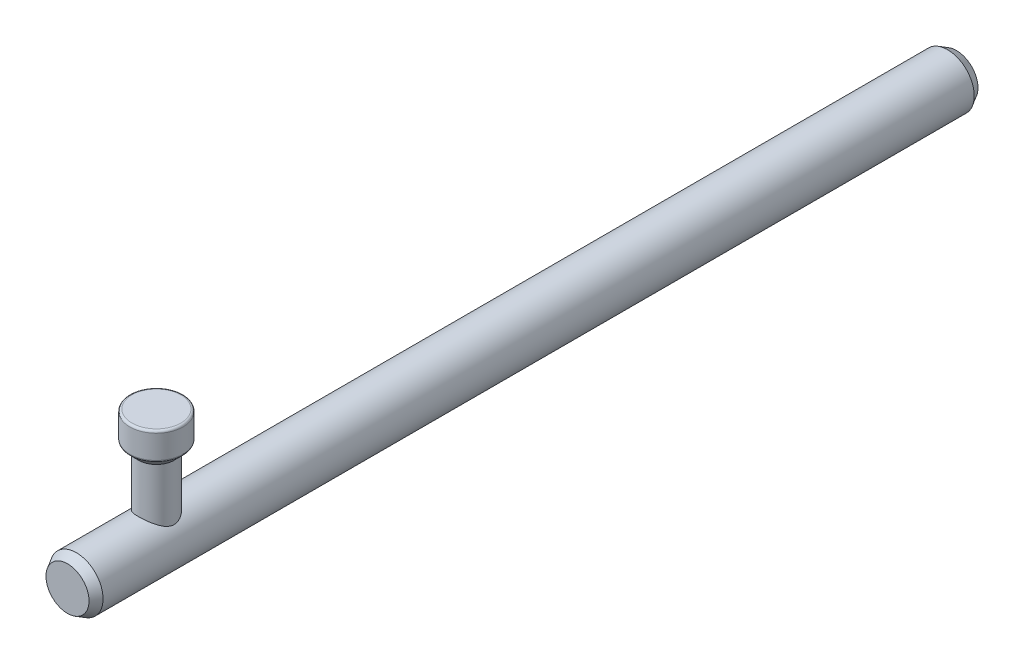
ISO-10303-21;
HEADER;
FILE_DESCRIPTION(('STEP AP214'),'2;1');
FILE_NAME('part.step','',(''),(''),'','','');
FILE_SCHEMA(('AUTOMOTIVE_DESIGN { 1 0 10303 214 1 1 1 1 }'));
ENDSEC;
DATA;
#1=APPLICATION_CONTEXT('core data for automotive mechanical design processes');
#2=APPLICATION_PROTOCOL_DEFINITION('international standard','automotive_design',2000,#1);
#3=PRODUCT_CONTEXT('',#1,'mechanical');
#4=PRODUCT('Part','Part','',(#3));
#5=PRODUCT_RELATED_PRODUCT_CATEGORY('part','',(#4));
#6=PRODUCT_DEFINITION_FORMATION('','',#4);
#7=PRODUCT_DEFINITION_CONTEXT('part definition',#1,'design');
#8=PRODUCT_DEFINITION('design','',#6,#7);
#9=PRODUCT_DEFINITION_SHAPE('','',#8);
#10=(LENGTH_UNIT() NAMED_UNIT(*) SI_UNIT(.MILLI.,.METRE.));
#11=(NAMED_UNIT(*) PLANE_ANGLE_UNIT() SI_UNIT($,.RADIAN.));
#12=(NAMED_UNIT(*) SI_UNIT($,.STERADIAN.) SOLID_ANGLE_UNIT());
#13=UNCERTAINTY_MEASURE_WITH_UNIT(LENGTH_MEASURE(1.E-05),#10,'distance_accuracy_value','');
#14=(GEOMETRIC_REPRESENTATION_CONTEXT(3) GLOBAL_UNCERTAINTY_ASSIGNED_CONTEXT((#13)) GLOBAL_UNIT_ASSIGNED_CONTEXT((#10,
#11,#12)) REPRESENTATION_CONTEXT('',''));
#15=CARTESIAN_POINT('',(0.,0.,0.));
#16=DIRECTION('',(0.,0.,1.));
#17=DIRECTION('',(1.,0.,0.));
#18=AXIS2_PLACEMENT_3D('',#15,#16,#17);
#19=CARTESIAN_POINT('',(0.,25.,30.));
#20=DIRECTION('',(0.,-1.,0.));
#21=DIRECTION('',(0.,0.,-1.));
#22=AXIS2_PLACEMENT_3D('',#19,#20,#21);
#23=CYLINDRICAL_SURFACE('',#22,4.);
#24=CARTESIAN_POINT('',(0.,6.,26.));
#25=CARTESIAN_POINT('',(0.200961877757264,5.9999978679194,26.000002684907));
#26=CARTESIAN_POINT('',(0.401936080773152,5.9898153135426,26.0152288882032));
#27=CARTESIAN_POINT('',(0.79746821055015,5.95009379035347,26.0751927794688));
#28=CARTESIAN_POINT('',(0.992023045089949,5.92054563204444,26.1199444781421));
#29=CARTESIAN_POINT('',(1.36842380232543,5.84500964767637,26.2362154427165));
#30=CARTESIAN_POINT('',(1.55032457441004,5.79909884319835,26.3076093722615));
#31=CARTESIAN_POINT('',(1.89883175306967,5.69452202411023,26.4741276344292));
#32=CARTESIAN_POINT('',(2.06543593424075,5.63585415772491,26.569255412479));
#33=CARTESIAN_POINT('',(2.3945652020353,5.50454977078536,26.7893099259876));
#34=CARTESIAN_POINT('',(2.55554447844211,5.43115036221203,26.9160803248433));
#35=CARTESIAN_POINT('',(2.85547224517315,5.27963383311262,27.1914755162046));
#36=CARTESIAN_POINT('',(2.994388569064,5.20151004959,27.3401316196154));
#37=CARTESIAN_POINT('',(3.19492879965059,5.07935723703535,27.5903838554454));
#38=CARTESIAN_POINT('',(3.26448421361659,5.03481061406829,27.6854700193812));
#39=CARTESIAN_POINT('',(3.39528506509656,4.94754748204559,27.8819829514974));
#40=CARTESIAN_POINT('',(3.45652861568795,4.90483139004999,27.9834111518107));
#41=CARTESIAN_POINT('',(3.62693348295433,4.78172496846676,28.2965761834164));
#42=CARTESIAN_POINT('',(3.72317686184202,4.70611539319262,28.5176988553784));
#43=CARTESIAN_POINT('',(3.85349251209103,4.59951859417335,28.9134467329049));
#44=CARTESIAN_POINT('',(3.89749210756546,4.56195075343585,29.08306337131));
#45=CARTESIAN_POINT('',(3.96300919832951,4.5051611944835,29.4294825551035));
#46=CARTESIAN_POINT('',(3.98456544550022,4.48590785845124,29.6062721648702));
#47=CARTESIAN_POINT('',(4.0038281338153,4.46873162662322,29.962951297351));
#48=CARTESIAN_POINT('',(4.00143708609998,4.47089592105774,30.1428505125676));
#49=CARTESIAN_POINT('',(3.97275139872465,4.49639563989106,30.4992694809422));
#50=CARTESIAN_POINT('',(3.94643650788514,4.51974900048769,30.6757862416243));
#51=CARTESIAN_POINT('',(3.8732999414292,4.58254368658664,31.0129342195374));
#52=CARTESIAN_POINT('',(3.82743424461755,4.62122975554716,31.1739227038778));
#53=CARTESIAN_POINT('',(3.7174023558469,4.71019246530652,31.4860473508856));
#54=CARTESIAN_POINT('',(3.65323014197261,4.76047291902481,31.6371802514341));
#55=CARTESIAN_POINT('',(3.49347638019647,4.87928392523269,31.9580508015759));
#56=CARTESIAN_POINT('',(3.39416104750469,4.94944635418484,32.1253198038974));
#57=CARTESIAN_POINT('',(3.17337920726675,5.09383075529723,32.4427667876367));
#58=CARTESIAN_POINT('',(3.05188537955521,5.16805765436997,32.5929233146677));
#59=CARTESIAN_POINT('',(2.75962330697744,5.33086687505155,32.9050850922479));
#60=CARTESIAN_POINT('',(2.58387876581438,5.41909489435193,33.0626680976423));
#61=CARTESIAN_POINT('',(2.20401599801903,5.58436201336345,33.3463929888004));
#62=CARTESIAN_POINT('',(1.99992459865342,5.6614115529751,33.4725642907514));
#63=CARTESIAN_POINT('',(1.60971565422037,5.78290808179582,33.6669554372993));
#64=CARTESIAN_POINT('',(1.42791528675113,5.83078522330773,33.7416867266922));
#65=CARTESIAN_POINT('',(1.05207208786365,5.91015438061304,33.8642098512364));
#66=CARTESIAN_POINT('',(0.858039758001339,5.9416602425517,33.9120244542606));
#67=CARTESIAN_POINT('',(0.461970906346524,5.98551764313533,33.9783223304799));
#68=CARTESIAN_POINT('',(0.259903623868821,5.99778644922351,33.9966789218776));
#69=CARTESIAN_POINT('',(-0.144883038779208,6.00166229930316,34.0024941771234));
#70=CARTESIAN_POINT('',(-0.347602372373328,5.99327078771277,33.9899550009772));
#71=CARTESIAN_POINT('',(-0.732911434408415,5.95799178848538,33.9367518888764));
#72=CARTESIAN_POINT('',(-0.915914889358571,5.93244492780442,33.8981254044898));
#73=CARTESIAN_POINT('',(-1.27223278485463,5.86636898569683,33.7968086279741));
#74=CARTESIAN_POINT('',(-1.44554567514149,5.82583751494007,33.734114498143));
#75=CARTESIAN_POINT('',(-1.78932950093283,5.72992705058283,33.5826954059108));
#76=CARTESIAN_POINT('',(-1.95899236926607,5.6737974027145,33.4926236918387));
#77=CARTESIAN_POINT('',(-2.28136604791135,5.55203711223142,33.291133420105));
#78=CARTESIAN_POINT('',(-2.43406629638971,5.48640060808333,33.1797016789266));
#79=CARTESIAN_POINT('',(-2.7437089096605,5.33909093306338,32.9187842636954));
#80=CARTESIAN_POINT('',(-2.89750375144749,5.25652313598236,32.7660674798918));
#81=CARTESIAN_POINT('',(-3.17867936133274,5.09142346174011,32.4377771400438));
#82=CARTESIAN_POINT('',(-3.30604187293363,5.00889164843552,32.2621879216275));
#83=CARTESIAN_POINT('',(-3.52249553117939,4.85879357933962,31.9057151746079));
#84=CARTESIAN_POINT('',(-3.61391272319835,4.79055194025588,31.7265359335926));
#85=CARTESIAN_POINT('',(-3.76992427411385,4.66877948558076,31.3522546945967));
#86=CARTESIAN_POINT('',(-3.83456691107298,4.61522225155449,31.157182121472));
#87=CARTESIAN_POINT('',(-3.9247168714152,4.53866416286692,30.7908710271828));
#88=CARTESIAN_POINT('',(-3.95517195853461,4.51189995773817,30.6216563856293));
#89=CARTESIAN_POINT('',(-3.99398411126519,4.477589331452,30.2788534319877));
#90=CARTESIAN_POINT('',(-4.00236517901677,4.47002203690265,30.1052700778009));
#91=CARTESIAN_POINT('',(-3.99647846633069,4.47528401304741,29.7587139064845));
#92=CARTESIAN_POINT('',(-3.98219727499794,4.48812536101584,29.5857415116217));
#93=CARTESIAN_POINT('',(-3.93193984471959,4.53220908525283,29.2453128684672));
#94=CARTESIAN_POINT('',(-3.89593466197412,4.56347600940483,29.0778642942634));
#95=CARTESIAN_POINT('',(-3.7918611850225,4.65053670224448,28.7085779792256));
#96=CARTESIAN_POINT('',(-3.71780572154622,4.71064593401662,28.5094660511132));
#97=CARTESIAN_POINT('',(-3.54168854300469,4.8444439609485,28.1290248521502));
#98=CARTESIAN_POINT('',(-3.43958750756441,4.91815177355726,27.9477210367039));
#99=CARTESIAN_POINT('',(-3.20797320614046,5.07234090111959,27.6014418943788));
#100=CARTESIAN_POINT('',(-3.07799480000577,5.15292108876611,27.4368238567084));
#101=CARTESIAN_POINT('',(-2.79340674971918,5.3125766931074,27.1293336893786));
#102=CARTESIAN_POINT('',(-2.63878955904371,5.39165164043383,26.9864682485441));
#103=CARTESIAN_POINT('',(-2.37780795718262,5.50971336238147,26.7812049322995));
#104=CARTESIAN_POINT('',(-2.27907205499528,5.55138661480074,26.7105163844043));
#105=CARTESIAN_POINT('',(-2.07453205585637,5.63101613508227,26.5778421431842));
#106=CARTESIAN_POINT('',(-1.96873124035977,5.66897410866294,26.5158524504125));
#107=CARTESIAN_POINT('',(-1.75068617470796,5.74005451433883,26.4013561420063));
#108=CARTESIAN_POINT('',(-1.63844803554364,5.77318143009499,26.3488407225116));
#109=CARTESIAN_POINT('',(-1.40828926088828,5.83360071790147,26.254038767796));
#110=CARTESIAN_POINT('',(-1.2903706384399,5.86089513849429,26.2117486404655));
#111=CARTESIAN_POINT('',(-0.982973724349344,5.92199193347713,26.1177431172572));
#112=CARTESIAN_POINT('',(-0.790052409981754,5.95101863539404,26.0737919233841));
#113=CARTESIAN_POINT('',(-0.398088285460987,5.99001656656924,26.0149299438736));
#114=CARTESIAN_POINT('',(-0.199050188671042,6.00000211179877,25.9999973406337));
#115=CARTESIAN_POINT('',(0.,6.,26.));
#116=B_SPLINE_CURVE_WITH_KNOTS('',3,(#24,#25,#26,#27,#28,#29,#30,#31,#32,#33,#34,#35,#36,#37,
#38,#39,#40,#41,#42,#43,#44,#45,#46,#47,#48,#49,#50,#51,#52,#53,#54,#55,#56,#57,#58,#59,#60,#61,
#62,#63,#64,#65,#66,#67,#68,#69,#70,#71,#72,#73,#74,#75,#76,#77,#78,#79,#80,#81,#82,#83,#84,#85,
#86,#87,#88,#89,#90,#91,#92,#93,#94,#95,#96,#97,#98,#99,#100,#101,#102,#103,#104,#105,#106,#107,
#108,#109,#110,#111,#112,#113,#114,#115),.UNSPECIFIED.,.T.,.F.,(4,2,2,2,2,2,2,2,2,2,2,2,2,2,2,2,
2,2,2,2,2,2,2,2,2,2,2,2,2,2,2,2,2,2,2,2,2,2,2,2,2,2,2,2,2,4),(0.,0.602106453010799,
1.20449882869738,1.80409230638046,2.40377287734773,3.05434058001113,3.70584823208637,
4.08328599770793,4.46080930477325,5.21378174776238,5.74934951237418,6.28399099576978,
6.82080987356117,7.35808358412064,7.87165288288699,8.38539131508568,9.00362713220158,
9.62262971458524,10.3750547289191,11.1267724450113,11.7311573929193,12.3350303418404,
12.9414933048691,13.5479138696524,14.1117373348335,14.6756507417495,15.2737225755744,
15.8721647378882,16.5652391618099,17.2587907024993,17.8936743450736,18.5274081717986,
19.0471565993068,19.5663396456459,20.085830044675,20.6060141160321,21.264807813068,
21.9245299065432,22.5962605430738,23.2681973183871,23.6528866112052,24.0373984529808,
24.4215511301868,24.8055686591805,25.4023963552989,25.9987751531553),.UNSPECIFIED.);
#117=CARTESIAN_POINT('',(0.,6.,26.));
#118=VERTEX_POINT('',#117);
#119=EDGE_CURVE('E74',#118,#118,#116,.T.);
#120=ORIENTED_EDGE('',*,*,#119,.F.);
#121=EDGE_LOOP('',(#120));
#122=FACE_BOUND('',#121,.T.);
#123=CARTESIAN_POINT('',(0.,17.,30.));
#124=DIRECTION('',(0.,1.,0.));
#125=DIRECTION('',(0.,0.,1.));
#126=AXIS2_PLACEMENT_3D('',#123,#124,#125);
#127=CIRCLE('',#126,4.);
#128=CARTESIAN_POINT('',(0.,17.,34.));
#129=VERTEX_POINT('',#128);
#130=EDGE_CURVE('E71',#129,#129,#127,.T.);
#131=ORIENTED_EDGE('',*,*,#130,.F.);
#132=EDGE_LOOP('',(#131));
#133=FACE_BOUND('',#132,.T.);
#134=ADVANCED_FACE('F39',(#122,#133),#23,.T.);
#135=CARTESIAN_POINT('',(0.,0.,-150.));
#136=DIRECTION('',(0.,0.,1.));
#137=DIRECTION('',(1.,0.,0.));
#138=AXIS2_PLACEMENT_3D('',#135,#136,#137);
#139=CYLINDRICAL_SURFACE('',#138,6.);
#140=CARTESIAN_POINT('',(0.,0.,-148.));
#141=DIRECTION('',(0.,0.,1.));
#142=DIRECTION('',(1.,0.,0.));
#143=AXIS2_PLACEMENT_3D('',#140,#141,#142);
#144=CIRCLE('',#143,6.);
#145=CARTESIAN_POINT('',(6.,0.,-148.));
#146=VERTEX_POINT('',#145);
#147=EDGE_CURVE('E65',#146,#146,#144,.T.);
#148=ORIENTED_EDGE('',*,*,#147,.T.);
#149=EDGE_LOOP('',(#148));
#150=FACE_BOUND('',#149,.T.);
#151=CARTESIAN_POINT('',(0.,0.,48.));
#152=DIRECTION('',(0.,0.,1.));
#153=DIRECTION('',(1.,0.,0.));
#154=AXIS2_PLACEMENT_3D('',#151,#152,#153);
#155=CIRCLE('',#154,6.);
#156=CARTESIAN_POINT('',(6.,0.,48.));
#157=VERTEX_POINT('',#156);
#158=EDGE_CURVE('E68',#157,#157,#155,.F.);
#159=ORIENTED_EDGE('',*,*,#158,.T.);
#160=EDGE_LOOP('',(#159));
#161=FACE_BOUND('',#160,.T.);
#162=ORIENTED_EDGE('',*,*,#119,.T.);
#163=EDGE_LOOP('',(#162));
#164=FACE_BOUND('',#163,.T.);
#165=ADVANCED_FACE('F81',(#150,#161,#164),#139,.T.);
#166=CARTESIAN_POINT('',(0.,0.,-150.));
#167=DIRECTION('',(0.,0.,1.));
#168=DIRECTION('',(1.,0.,0.));
#169=AXIS2_PLACEMENT_3D('',#166,#167,#168);
#170=PLANE('',#169);
#171=CARTESIAN_POINT('',(0.,0.,-150.));
#172=DIRECTION('',(0.,0.,1.));
#173=DIRECTION('',(1.,0.,0.));
#174=AXIS2_PLACEMENT_3D('',#171,#172,#173);
#175=CIRCLE('',#174,4.84529946162073);
#176=CARTESIAN_POINT('',(4.84529946162073,0.,-150.));
#177=VERTEX_POINT('',#176);
#178=EDGE_CURVE('E62',#177,#177,#175,.F.);
#179=ORIENTED_EDGE('',*,*,#178,.T.);
#180=EDGE_LOOP('',(#179));
#181=FACE_BOUND('',#180,.T.);
#182=ADVANCED_FACE('F95',(#181),#170,.F.);
#183=CARTESIAN_POINT('',(0.,0.,50.));
#184=DIRECTION('',(0.,0.,1.));
#185=DIRECTION('',(1.,0.,0.));
#186=AXIS2_PLACEMENT_3D('',#183,#184,#185);
#187=PLANE('',#186);
#188=CARTESIAN_POINT('',(0.,0.,50.));
#189=DIRECTION('',(0.,0.,1.));
#190=DIRECTION('',(1.,0.,0.));
#191=AXIS2_PLACEMENT_3D('',#188,#189,#190);
#192=CIRCLE('',#191,4.84529946162073);
#193=CARTESIAN_POINT('',(4.84529946162073,0.,50.));
#194=VERTEX_POINT('',#193);
#195=EDGE_CURVE('E59',#194,#194,#192,.T.);
#196=ORIENTED_EDGE('',*,*,#195,.T.);
#197=EDGE_LOOP('',(#196));
#198=FACE_BOUND('',#197,.T.);
#199=ADVANCED_FACE('F92',(#198),#187,.T.);
#200=CARTESIAN_POINT('',(0.,17.,30.));
#201=DIRECTION('',(0.,1.,0.));
#202=DIRECTION('',(0.,0.,1.));
#203=AXIS2_PLACEMENT_3D('',#200,#201,#202);
#204=CYLINDRICAL_SURFACE('',#203,6.);
#205=CARTESIAN_POINT('',(0.,19.2071067811865,30.));
#206=DIRECTION('',(0.,-1.,0.));
#207=DIRECTION('',(0.,0.,-1.));
#208=AXIS2_PLACEMENT_3D('',#205,#206,#207);
#209=CIRCLE('',#208,6.);
#210=CARTESIAN_POINT('',(0.,19.2071067811865,24.));
#211=VERTEX_POINT('',#210);
#212=EDGE_CURVE('E50',#211,#211,#209,.F.);
#213=ORIENTED_EDGE('',*,*,#212,.T.);
#214=EDGE_LOOP('',(#213));
#215=FACE_BOUND('',#214,.T.);
#216=CARTESIAN_POINT('',(0.,24.5,30.));
#217=DIRECTION('',(0.,1.,0.));
#218=DIRECTION('',(0.,0.,1.));
#219=AXIS2_PLACEMENT_3D('',#216,#217,#218);
#220=CIRCLE('',#219,6.);
#221=CARTESIAN_POINT('',(0.,24.5,36.));
#222=VERTEX_POINT('',#221);
#223=EDGE_CURVE('E54',#222,#222,#220,.F.);
#224=ORIENTED_EDGE('',*,*,#223,.T.);
#225=EDGE_LOOP('',(#224));
#226=FACE_BOUND('',#225,.T.);
#227=ADVANCED_FACE('F94',(#215,#226),#204,.T.);
#228=CARTESIAN_POINT('',(0.,25.,30.));
#229=DIRECTION('',(0.,1.,0.));
#230=DIRECTION('',(0.,0.,1.));
#231=AXIS2_PLACEMENT_3D('',#228,#229,#230);
#232=PLANE('',#231);
#233=CARTESIAN_POINT('',(0.,25.,30.));
#234=DIRECTION('',(0.,1.,0.));
#235=DIRECTION('',(0.,0.,1.));
#236=AXIS2_PLACEMENT_3D('',#233,#234,#235);
#237=CIRCLE('',#236,5.5);
#238=CARTESIAN_POINT('',(0.,25.,35.5));
#239=VERTEX_POINT('',#238);
#240=EDGE_CURVE('E10',#239,#239,#237,.T.);
#241=ORIENTED_EDGE('',*,*,#240,.T.);
#242=EDGE_LOOP('',(#241));
#243=FACE_BOUND('',#242,.T.);
#244=ADVANCED_FACE('F90',(#243),#232,.T.);
#245=CARTESIAN_POINT('',(0.,0.,-148.));
#246=DIRECTION('',(0.,0.,1.));
#247=DIRECTION('',(1.,0.,0.));
#248=AXIS2_PLACEMENT_3D('',#245,#246,#247);
#249=CONICAL_SURFACE('',#248,6.,0.523598775598296);
#250=ORIENTED_EDGE('',*,*,#178,.F.);
#251=EDGE_LOOP('',(#250));
#252=FACE_BOUND('',#251,.T.);
#253=ORIENTED_EDGE('',*,*,#147,.F.);
#254=EDGE_LOOP('',(#253));
#255=FACE_BOUND('',#254,.T.);
#256=ADVANCED_FACE('F105',(#252,#255),#249,.T.);
#257=CARTESIAN_POINT('',(0.,0.,50.));
#258=DIRECTION('',(0.,0.,-1.));
#259=DIRECTION('',(-1.,0.,0.));
#260=AXIS2_PLACEMENT_3D('',#257,#258,#259);
#261=CONICAL_SURFACE('',#260,4.84529946162073,0.523598775598296);
#262=ORIENTED_EDGE('',*,*,#158,.F.);
#263=EDGE_LOOP('',(#262));
#264=FACE_BOUND('',#263,.T.);
#265=ORIENTED_EDGE('',*,*,#195,.F.);
#266=EDGE_LOOP('',(#265));
#267=FACE_BOUND('',#266,.T.);
#268=ADVANCED_FACE('F108',(#264,#267),#261,.T.);
#269=CARTESIAN_POINT('',(0.,19.,30.));
#270=DIRECTION('',(0.,1.,0.));
#271=DIRECTION('',(0.,0.,1.));
#272=AXIS2_PLACEMENT_3D('',#269,#270,#271);
#273=CONICAL_SURFACE('',#272,6.,0.785398163397446);
#274=CARTESIAN_POINT('',(0.,18.8535533905933,30.));
#275=DIRECTION('',(0.,-1.,0.));
#276=DIRECTION('',(0.,0.,-1.));
#277=AXIS2_PLACEMENT_3D('',#274,#275,#276);
#278=CIRCLE('',#277,5.85355339059328);
#279=CARTESIAN_POINT('',(0.,18.8535533905933,24.1464466094067));
#280=VERTEX_POINT('',#279);
#281=EDGE_CURVE('E46',#280,#280,#278,.T.);
#282=ORIENTED_EDGE('',*,*,#281,.T.);
#283=EDGE_LOOP('',(#282));
#284=FACE_BOUND('',#283,.T.);
#285=ORIENTED_EDGE('',*,*,#130,.T.);
#286=EDGE_LOOP('',(#285));
#287=FACE_BOUND('',#286,.T.);
#288=ADVANCED_FACE('F117',(#284,#287),#273,.T.);
#289=CARTESIAN_POINT('',(0.,19.2071067811865,30.));
#290=DIRECTION('',(0.,-1.,0.));
#291=DIRECTION('',(0.,0.,-1.));
#292=AXIS2_PLACEMENT_3D('',#289,#290,#291);
#293=TOROIDAL_SURFACE('',#292,5.5,0.5);
#294=ORIENTED_EDGE('',*,*,#281,.F.);
#295=EDGE_LOOP('',(#294));
#296=FACE_BOUND('',#295,.T.);
#297=ORIENTED_EDGE('',*,*,#212,.F.);
#298=EDGE_LOOP('',(#297));
#299=FACE_BOUND('',#298,.T.);
#300=ADVANCED_FACE('F119',(#296,#299),#293,.T.);
#301=CARTESIAN_POINT('',(0.,24.5,30.));
#302=DIRECTION('',(0.,1.,0.));
#303=DIRECTION('',(0.,0.,1.));
#304=AXIS2_PLACEMENT_3D('',#301,#302,#303);
#305=TOROIDAL_SURFACE('',#304,5.5,0.5);
#306=ORIENTED_EDGE('',*,*,#223,.F.);
#307=EDGE_LOOP('',(#306));
#308=FACE_BOUND('',#307,.T.);
#309=ORIENTED_EDGE('',*,*,#240,.F.);
#310=EDGE_LOOP('',(#309));
#311=FACE_BOUND('',#310,.T.);
#312=ADVANCED_FACE('F41',(#308,#311),#305,.T.);
#313=CLOSED_SHELL('',(#134,#165,#182,#199,#227,#244,#256,#268,#288,#300,#312));
#314=MANIFOLD_SOLID_BREP('B2',#313);
#315=ADVANCED_BREP_SHAPE_REPRESENTATION('',(#18,#314),#14);
#316=SHAPE_DEFINITION_REPRESENTATION(#9,#315);
ENDSEC;
END-ISO-10303-21;
